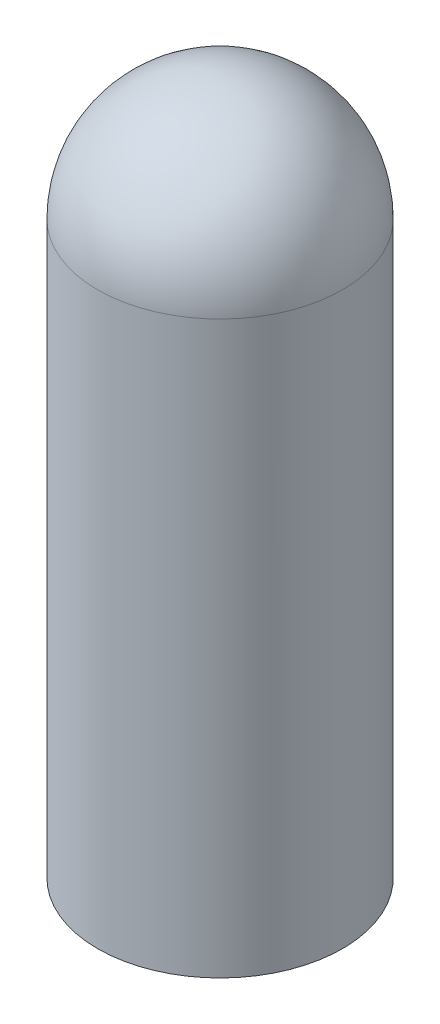
ISO-10303-21;
HEADER;
FILE_DESCRIPTION(('STEP AP214'),'2;1');
FILE_NAME('part.step','',(''),(''),'','','');
FILE_SCHEMA(('AUTOMOTIVE_DESIGN { 1 0 10303 214 1 1 1 1 }'));
ENDSEC;
DATA;
#1=APPLICATION_CONTEXT('core data for automotive mechanical design processes');
#2=APPLICATION_PROTOCOL_DEFINITION('international standard','automotive_design',2000,#1);
#3=PRODUCT_CONTEXT('',#1,'mechanical');
#4=PRODUCT('Part','Part','',(#3));
#5=PRODUCT_RELATED_PRODUCT_CATEGORY('part','',(#4));
#6=PRODUCT_DEFINITION_FORMATION('','',#4);
#7=PRODUCT_DEFINITION_CONTEXT('part definition',#1,'design');
#8=PRODUCT_DEFINITION('design','',#6,#7);
#9=PRODUCT_DEFINITION_SHAPE('','',#8);
#10=(LENGTH_UNIT() NAMED_UNIT(*) SI_UNIT(.MILLI.,.METRE.));
#11=(NAMED_UNIT(*) PLANE_ANGLE_UNIT() SI_UNIT($,.RADIAN.));
#12=(NAMED_UNIT(*) SI_UNIT($,.STERADIAN.) SOLID_ANGLE_UNIT());
#13=UNCERTAINTY_MEASURE_WITH_UNIT(LENGTH_MEASURE(1.E-05),#10,'distance_accuracy_value','');
#14=(GEOMETRIC_REPRESENTATION_CONTEXT(3) GLOBAL_UNCERTAINTY_ASSIGNED_CONTEXT((#13)) GLOBAL_UNIT_ASSIGNED_CONTEXT((#10,
#11,#12)) REPRESENTATION_CONTEXT('',''));
#15=CARTESIAN_POINT('',(0.,0.,0.));
#16=DIRECTION('',(0.,0.,1.));
#17=DIRECTION('',(1.,0.,0.));
#18=AXIS2_PLACEMENT_3D('',#15,#16,#17);
#19=CARTESIAN_POINT('',(-6.731,0.,0.));
#20=DIRECTION('',(0.,-1.,0.));
#21=DIRECTION('',(0.,0.,-1.));
#22=AXIS2_PLACEMENT_3D('',#19,#20,#21);
#23=PLANE('',#22);
#24=CARTESIAN_POINT('',(0.,0.,0.));
#25=DIRECTION('',(0.,-1.,0.));
#26=DIRECTION('',(0.,0.,-1.));
#27=AXIS2_PLACEMENT_3D('',#24,#25,#26);
#28=CIRCLE('',#27,6.35);
#29=CARTESIAN_POINT('',(0.,0.,-6.35));
#30=VERTEX_POINT('',#29);
#31=EDGE_CURVE('E44',#30,#30,#28,.T.);
#32=ORIENTED_EDGE('',*,*,#31,.F.);
#33=EDGE_LOOP('',(#32));
#34=FACE_BOUND('',#33,.T.);
#35=CARTESIAN_POINT('',(0.,0.,0.));
#36=DIRECTION('',(0.,1.,0.));
#37=DIRECTION('',(0.,0.,1.));
#38=AXIS2_PLACEMENT_3D('',#35,#36,#37);
#39=CIRCLE('',#38,6.731);
#40=CARTESIAN_POINT('',(0.,0.,6.731));
#41=VERTEX_POINT('',#40);
#42=EDGE_CURVE('E10',#41,#41,#39,.T.);
#43=ORIENTED_EDGE('',*,*,#42,.F.);
#44=EDGE_LOOP('',(#43));
#45=FACE_BOUND('',#44,.T.);
#46=ADVANCED_FACE('F30',(#34,#45),#23,.T.);
#47=CARTESIAN_POINT('',(0.,0.,0.));
#48=DIRECTION('',(0.,1.,0.));
#49=DIRECTION('',(0.,0.,1.));
#50=AXIS2_PLACEMENT_3D('',#47,#48,#49);
#51=CYLINDRICAL_SURFACE('',#50,6.731);
#52=ORIENTED_EDGE('',*,*,#42,.T.);
#53=EDGE_LOOP('',(#52));
#54=FACE_BOUND('',#53,.T.);
#55=CARTESIAN_POINT('',(0.,31.369,0.));
#56=DIRECTION('',(0.,1.,0.));
#57=DIRECTION('',(0.,0.,1.));
#58=AXIS2_PLACEMENT_3D('',#55,#56,#57);
#59=CIRCLE('',#58,6.731);
#60=CARTESIAN_POINT('',(0.,31.369,6.731));
#61=VERTEX_POINT('',#60);
#62=EDGE_CURVE('E36',#61,#61,#59,.T.);
#63=ORIENTED_EDGE('',*,*,#62,.F.);
#64=EDGE_LOOP('',(#63));
#65=FACE_BOUND('',#64,.T.);
#66=ADVANCED_FACE('F54',(#54,#65),#51,.T.);
#67=CARTESIAN_POINT('',(0.,31.369,0.));
#68=DIRECTION('',(0.,1.,0.));
#69=DIRECTION('',(-1.,0.,0.));
#70=AXIS2_PLACEMENT_3D('',#67,#68,#69);
#71=SPHERICAL_SURFACE('',#70,6.731);
#72=ORIENTED_EDGE('',*,*,#62,.T.);
#73=EDGE_LOOP('',(#72));
#74=FACE_BOUND('',#73,.T.);
#75=ADVANCED_FACE('F58',(#74),#71,.T.);
#76=CARTESIAN_POINT('',(0.,31.496,0.));
#77=DIRECTION('',(0.,-1.,0.));
#78=DIRECTION('',(0.,0.,-1.));
#79=AXIS2_PLACEMENT_3D('',#76,#77,#78);
#80=CYLINDRICAL_SURFACE('',#79,6.35);
#81=CARTESIAN_POINT('',(0.,31.496,0.));
#82=DIRECTION('',(0.,-1.,0.));
#83=DIRECTION('',(0.,0.,-1.));
#84=AXIS2_PLACEMENT_3D('',#81,#82,#83);
#85=CIRCLE('',#84,6.35);
#86=CARTESIAN_POINT('',(0.,31.496,-6.35));
#87=VERTEX_POINT('',#86);
#88=EDGE_CURVE('E40',#87,#87,#85,.T.);
#89=ORIENTED_EDGE('',*,*,#88,.F.);
#90=EDGE_LOOP('',(#89));
#91=FACE_BOUND('',#90,.T.);
#92=ORIENTED_EDGE('',*,*,#31,.T.);
#93=EDGE_LOOP('',(#92));
#94=FACE_BOUND('',#93,.T.);
#95=ADVANCED_FACE('F50',(#91,#94),#80,.F.);
#96=CARTESIAN_POINT('',(0.,31.496,0.));
#97=DIRECTION('',(0.,-1.,0.));
#98=DIRECTION('',(0.,0.,-1.));
#99=AXIS2_PLACEMENT_3D('',#96,#97,#98);
#100=PLANE('',#99);
#101=ORIENTED_EDGE('',*,*,#88,.T.);
#102=EDGE_LOOP('',(#101));
#103=FACE_BOUND('',#102,.T.);
#104=ADVANCED_FACE('F67',(#103),#100,.T.);
#105=CLOSED_SHELL('',(#46,#66,#75,#95,#104));
#106=MANIFOLD_SOLID_BREP('B2',#105);
#107=ADVANCED_BREP_SHAPE_REPRESENTATION('',(#18,#106),#14);
#108=SHAPE_DEFINITION_REPRESENTATION(#9,#107);
ENDSEC;
END-ISO-10303-21;
